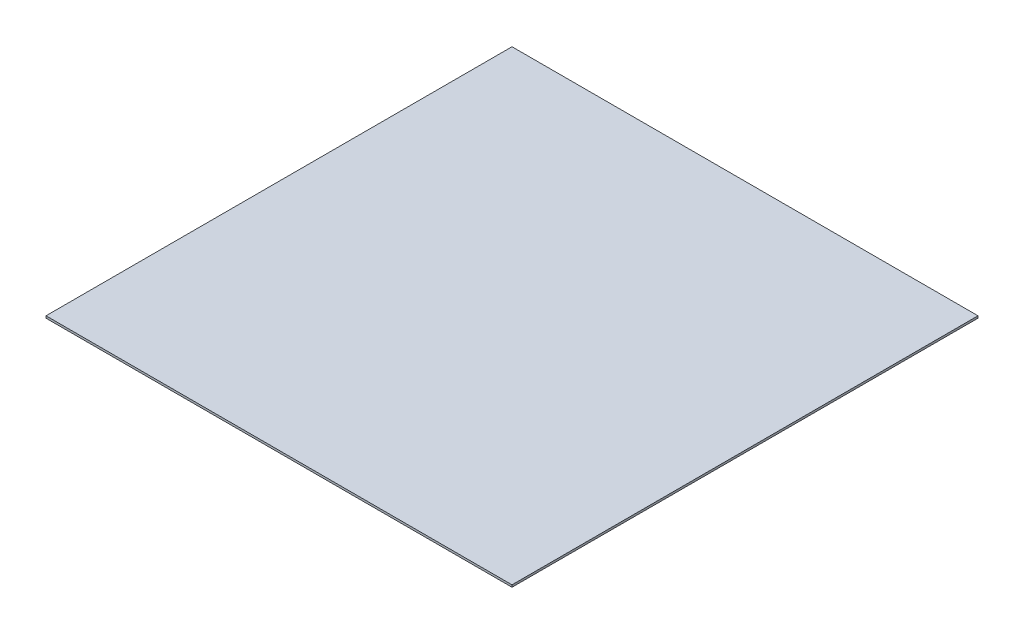
ISO-10303-21;
HEADER;
FILE_DESCRIPTION(('STEP AP214'),'2;1');
FILE_NAME('part.step','',(''),(''),'','','');
FILE_SCHEMA(('AUTOMOTIVE_DESIGN { 1 0 10303 214 1 1 1 1 }'));
ENDSEC;
DATA;
#1=APPLICATION_CONTEXT('core data for automotive mechanical design processes');
#2=APPLICATION_PROTOCOL_DEFINITION('international standard','automotive_design',2000,#1);
#3=PRODUCT_CONTEXT('',#1,'mechanical');
#4=PRODUCT('Part','Part','',(#3));
#5=PRODUCT_RELATED_PRODUCT_CATEGORY('part','',(#4));
#6=PRODUCT_DEFINITION_FORMATION('','',#4);
#7=PRODUCT_DEFINITION_CONTEXT('part definition',#1,'design');
#8=PRODUCT_DEFINITION('design','',#6,#7);
#9=PRODUCT_DEFINITION_SHAPE('','',#8);
#10=(LENGTH_UNIT() NAMED_UNIT(*) SI_UNIT(.MILLI.,.METRE.));
#11=(NAMED_UNIT(*) PLANE_ANGLE_UNIT() SI_UNIT($,.RADIAN.));
#12=(NAMED_UNIT(*) SI_UNIT($,.STERADIAN.) SOLID_ANGLE_UNIT());
#13=UNCERTAINTY_MEASURE_WITH_UNIT(LENGTH_MEASURE(1.E-05),#10,'distance_accuracy_value','');
#14=(GEOMETRIC_REPRESENTATION_CONTEXT(3) GLOBAL_UNCERTAINTY_ASSIGNED_CONTEXT((#13)) GLOBAL_UNIT_ASSIGNED_CONTEXT((#10,
#11,#12)) REPRESENTATION_CONTEXT('',''));
#15=CARTESIAN_POINT('',(0.,0.,0.));
#16=DIRECTION('',(0.,0.,1.));
#17=DIRECTION('',(1.,0.,0.));
#18=AXIS2_PLACEMENT_3D('',#15,#16,#17);
#19=CARTESIAN_POINT('',(609.6,5.55625,609.6));
#20=DIRECTION('',(-1.,0.,0.));
#21=DIRECTION('',(0.,0.,1.));
#22=AXIS2_PLACEMENT_3D('',#19,#20,#21);
#23=PLANE('',#22);
#24=DIRECTION('',(0.,0.,-1.));
#25=VECTOR('',#24,1.);
#26=CARTESIAN_POINT('',(609.6,0.,609.6));
#27=LINE('',#26,#25);
#28=CARTESIAN_POINT('',(609.6,0.,609.6));
#29=VERTEX_POINT('',#28);
#30=CARTESIAN_POINT('',(609.6,0.,-609.6));
#31=VERTEX_POINT('',#30);
#32=EDGE_CURVE('E113',#29,#31,#27,.T.);
#33=ORIENTED_EDGE('',*,*,#32,.T.);
#34=DIRECTION('',(0.,-1.,0.));
#35=VECTOR('',#34,1.);
#36=CARTESIAN_POINT('',(609.6,5.55625,-609.6));
#37=LINE('',#36,#35);
#38=CARTESIAN_POINT('',(609.6,5.55625,-609.6));
#39=VERTEX_POINT('',#38);
#40=EDGE_CURVE('E11',#39,#31,#37,.T.);
#41=ORIENTED_EDGE('',*,*,#40,.F.);
#42=DIRECTION('',(0.,0.,-1.));
#43=VECTOR('',#42,1.);
#44=CARTESIAN_POINT('',(609.6,5.55625,609.6));
#45=LINE('',#44,#43);
#46=CARTESIAN_POINT('',(609.6,5.55625,609.6));
#47=VERTEX_POINT('',#46);
#48=EDGE_CURVE('E97',#47,#39,#45,.T.);
#49=ORIENTED_EDGE('',*,*,#48,.F.);
#50=DIRECTION('',(0.,-1.,0.));
#51=VECTOR('',#50,1.);
#52=CARTESIAN_POINT('',(609.6,5.55625,609.6));
#53=LINE('',#52,#51);
#54=EDGE_CURVE('E109',#47,#29,#53,.T.);
#55=ORIENTED_EDGE('',*,*,#54,.T.);
#56=EDGE_LOOP('',(#33,#41,#49,#55));
#57=FACE_BOUND('',#56,.T.);
#58=ADVANCED_FACE('F45',(#57),#23,.F.);
#59=CARTESIAN_POINT('',(-609.6,5.55625,-609.6));
#60=DIRECTION('',(0.,0.,1.));
#61=DIRECTION('',(1.,0.,0.));
#62=AXIS2_PLACEMENT_3D('',#59,#60,#61);
#63=PLANE('',#62);
#64=DIRECTION('',(-1.,0.,0.));
#65=VECTOR('',#64,1.);
#66=CARTESIAN_POINT('',(-609.6,0.,-609.6));
#67=LINE('',#66,#65);
#68=CARTESIAN_POINT('',(-609.6,0.,-609.6));
#69=VERTEX_POINT('',#68);
#70=EDGE_CURVE('E102',#31,#69,#67,.T.);
#71=ORIENTED_EDGE('',*,*,#70,.T.);
#72=DIRECTION('',(0.,-1.,0.));
#73=VECTOR('',#72,1.);
#74=CARTESIAN_POINT('',(-609.6,5.55625,-609.6));
#75=LINE('',#74,#73);
#76=CARTESIAN_POINT('',(-609.6,5.55625,-609.6));
#77=VERTEX_POINT('',#76);
#78=EDGE_CURVE('E54',#77,#69,#75,.T.);
#79=ORIENTED_EDGE('',*,*,#78,.F.);
#80=DIRECTION('',(-1.,0.,0.));
#81=VECTOR('',#80,1.);
#82=CARTESIAN_POINT('',(-609.6,5.55625,-609.6));
#83=LINE('',#82,#81);
#84=EDGE_CURVE('E92',#39,#77,#83,.T.);
#85=ORIENTED_EDGE('',*,*,#84,.F.);
#86=ORIENTED_EDGE('',*,*,#40,.T.);
#87=EDGE_LOOP('',(#71,#79,#85,#86));
#88=FACE_BOUND('',#87,.T.);
#89=ADVANCED_FACE('F101',(#88),#63,.F.);
#90=CARTESIAN_POINT('',(-609.6,5.55625,609.6));
#91=DIRECTION('',(1.,0.,0.));
#92=DIRECTION('',(0.,0.,-1.));
#93=AXIS2_PLACEMENT_3D('',#90,#91,#92);
#94=PLANE('',#93);
#95=DIRECTION('',(0.,0.,1.));
#96=VECTOR('',#95,1.);
#97=CARTESIAN_POINT('',(-609.6,0.,609.6));
#98=LINE('',#97,#96);
#99=CARTESIAN_POINT('',(-609.6,0.,609.6));
#100=VERTEX_POINT('',#99);
#101=EDGE_CURVE('E79',#69,#100,#98,.T.);
#102=ORIENTED_EDGE('',*,*,#101,.T.);
#103=DIRECTION('',(0.,-1.,0.));
#104=VECTOR('',#103,1.);
#105=CARTESIAN_POINT('',(-609.6,5.55625,609.6));
#106=LINE('',#105,#104);
#107=CARTESIAN_POINT('',(-609.6,5.55625,609.6));
#108=VERTEX_POINT('',#107);
#109=EDGE_CURVE('E104',#108,#100,#106,.T.);
#110=ORIENTED_EDGE('',*,*,#109,.F.);
#111=DIRECTION('',(0.,0.,1.));
#112=VECTOR('',#111,1.);
#113=CARTESIAN_POINT('',(-609.6,5.55625,609.6));
#114=LINE('',#113,#112);
#115=EDGE_CURVE('E95',#77,#108,#114,.T.);
#116=ORIENTED_EDGE('',*,*,#115,.F.);
#117=ORIENTED_EDGE('',*,*,#78,.T.);
#118=EDGE_LOOP('',(#102,#110,#116,#117));
#119=FACE_BOUND('',#118,.T.);
#120=ADVANCED_FACE('F105',(#119),#94,.F.);
#121=CARTESIAN_POINT('',(-609.6,5.55625,609.6));
#122=DIRECTION('',(0.,0.,-1.));
#123=DIRECTION('',(-1.,0.,0.));
#124=AXIS2_PLACEMENT_3D('',#121,#122,#123);
#125=PLANE('',#124);
#126=DIRECTION('',(1.,0.,0.));
#127=VECTOR('',#126,1.);
#128=CARTESIAN_POINT('',(-609.6,0.,609.6));
#129=LINE('',#128,#127);
#130=EDGE_CURVE('E85',#100,#29,#129,.T.);
#131=ORIENTED_EDGE('',*,*,#130,.T.);
#132=ORIENTED_EDGE('',*,*,#54,.F.);
#133=DIRECTION('',(1.,0.,0.));
#134=VECTOR('',#133,1.);
#135=CARTESIAN_POINT('',(-609.6,5.55625,609.6));
#136=LINE('',#135,#134);
#137=EDGE_CURVE('E62',#108,#47,#136,.T.);
#138=ORIENTED_EDGE('',*,*,#137,.F.);
#139=ORIENTED_EDGE('',*,*,#109,.T.);
#140=EDGE_LOOP('',(#131,#132,#138,#139));
#141=FACE_BOUND('',#140,.T.);
#142=ADVANCED_FACE('F126',(#141),#125,.F.);
#143=CARTESIAN_POINT('',(0.,5.55625,0.));
#144=DIRECTION('',(0.,-1.,0.));
#145=DIRECTION('',(0.,0.,-1.));
#146=AXIS2_PLACEMENT_3D('',#143,#144,#145);
#147=PLANE('',#146);
#148=ORIENTED_EDGE('',*,*,#48,.T.);
#149=ORIENTED_EDGE('',*,*,#84,.T.);
#150=ORIENTED_EDGE('',*,*,#115,.T.);
#151=ORIENTED_EDGE('',*,*,#137,.T.);
#152=EDGE_LOOP('',(#148,#149,#150,#151));
#153=FACE_BOUND('',#152,.T.);
#154=ADVANCED_FACE('F93',(#153),#147,.F.);
#155=CARTESIAN_POINT('',(0.,0.,0.));
#156=DIRECTION('',(0.,-1.,0.));
#157=DIRECTION('',(0.,0.,-1.));
#158=AXIS2_PLACEMENT_3D('',#155,#156,#157);
#159=PLANE('',#158);
#160=ORIENTED_EDGE('',*,*,#32,.F.);
#161=ORIENTED_EDGE('',*,*,#130,.F.);
#162=ORIENTED_EDGE('',*,*,#101,.F.);
#163=ORIENTED_EDGE('',*,*,#70,.F.);
#164=EDGE_LOOP('',(#160,#161,#162,#163));
#165=FACE_BOUND('',#164,.T.);
#166=ADVANCED_FACE('F129',(#165),#159,.T.);
#167=CLOSED_SHELL('',(#58,#89,#120,#142,#154,#166));
#168=MANIFOLD_SOLID_BREP('B2',#167);
#169=ADVANCED_BREP_SHAPE_REPRESENTATION('',(#18,#168),#14);
#170=SHAPE_DEFINITION_REPRESENTATION(#9,#169);
ENDSEC;
END-ISO-10303-21;
